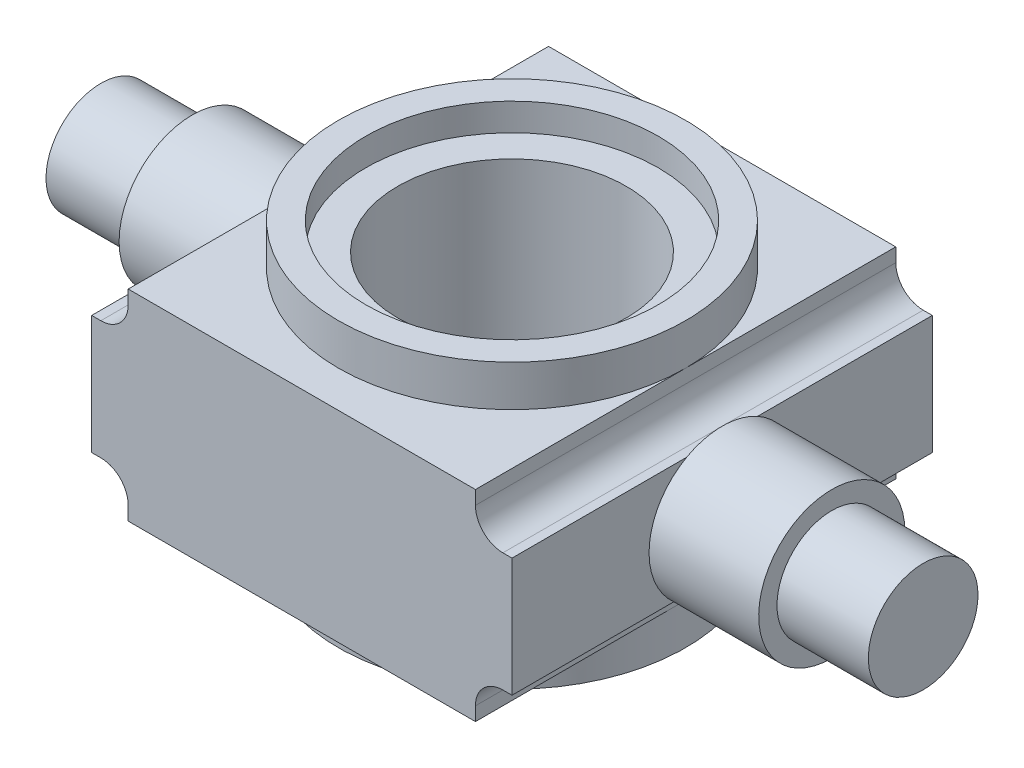
ISO-10303-21;
HEADER;
FILE_DESCRIPTION(('STEP AP214'),'2;1');
FILE_NAME('part.step','',(''),(''),'','','');
FILE_SCHEMA(('AUTOMOTIVE_DESIGN { 1 0 10303 214 1 1 1 1 }'));
ENDSEC;
DATA;
#1=APPLICATION_CONTEXT('core data for automotive mechanical design processes');
#2=APPLICATION_PROTOCOL_DEFINITION('international standard','automotive_design',2000,#1);
#3=PRODUCT_CONTEXT('',#1,'mechanical');
#4=PRODUCT('Part','Part','',(#3));
#5=PRODUCT_RELATED_PRODUCT_CATEGORY('part','',(#4));
#6=PRODUCT_DEFINITION_FORMATION('','',#4);
#7=PRODUCT_DEFINITION_CONTEXT('part definition',#1,'design');
#8=PRODUCT_DEFINITION('design','',#6,#7);
#9=PRODUCT_DEFINITION_SHAPE('','',#8);
#10=(LENGTH_UNIT() NAMED_UNIT(*) SI_UNIT(.MILLI.,.METRE.));
#11=(NAMED_UNIT(*) PLANE_ANGLE_UNIT() SI_UNIT($,.RADIAN.));
#12=(NAMED_UNIT(*) SI_UNIT($,.STERADIAN.) SOLID_ANGLE_UNIT());
#13=UNCERTAINTY_MEASURE_WITH_UNIT(LENGTH_MEASURE(1.E-05),#10,'distance_accuracy_value','');
#14=(GEOMETRIC_REPRESENTATION_CONTEXT(3) GLOBAL_UNCERTAINTY_ASSIGNED_CONTEXT((#13)) GLOBAL_UNIT_ASSIGNED_CONTEXT((#10,
#11,#12)) REPRESENTATION_CONTEXT('',''));
#15=CARTESIAN_POINT('',(0.,0.,0.));
#16=DIRECTION('',(0.,0.,1.));
#17=DIRECTION('',(1.,0.,0.));
#18=AXIS2_PLACEMENT_3D('',#15,#16,#17);
#19=CARTESIAN_POINT('',(23.,22.,-23.));
#20=DIRECTION('',(-1.,0.,0.));
#21=DIRECTION('',(0.,0.,1.));
#22=AXIS2_PLACEMENT_3D('',#19,#20,#21);
#23=PLANE('',#22);
#24=DIRECTION('',(0.,-1.,0.));
#25=VECTOR('',#24,1.);
#26=CARTESIAN_POINT('',(23.,22.,-23.));
#27=LINE('',#26,#25);
#28=CARTESIAN_POINT('',(23.,17.5,-23.));
#29=VERTEX_POINT('',#28);
#30=CARTESIAN_POINT('',(23.,4.5,-23.));
#31=VERTEX_POINT('',#30);
#32=EDGE_CURVE('E47',#29,#31,#27,.T.);
#33=ORIENTED_EDGE('',*,*,#32,.F.);
#34=DIRECTION('',(0.,0.,1.));
#35=VECTOR('',#34,1.);
#36=CARTESIAN_POINT('',(23.,17.5,-23.));
#37=LINE('',#36,#35);
#38=CARTESIAN_POINT('',(23.,17.5,-3.88327264948309));
#39=VERTEX_POINT('',#38);
#40=EDGE_CURVE('E480',#29,#39,#37,.T.);
#41=ORIENTED_EDGE('',*,*,#40,.T.);
#42=CARTESIAN_POINT('',(23.,10.5057027851416,0.));
#43=DIRECTION('',(1.,0.,0.));
#44=DIRECTION('',(0.,0.,-1.));
#45=AXIS2_PLACEMENT_3D('',#42,#43,#44);
#46=CIRCLE('',#45,8.);
#47=CARTESIAN_POINT('',(23.,4.5,-5.28502923894873));
#48=VERTEX_POINT('',#47);
#49=EDGE_CURVE('E418',#48,#39,#46,.T.);
#50=ORIENTED_EDGE('',*,*,#49,.F.);
#51=DIRECTION('',(0.,0.,1.));
#52=VECTOR('',#51,1.);
#53=CARTESIAN_POINT('',(23.,4.5,-23.));
#54=LINE('',#53,#52);
#55=EDGE_CURVE('E61',#31,#48,#54,.T.);
#56=ORIENTED_EDGE('',*,*,#55,.F.);
#57=EDGE_LOOP('',(#33,#41,#50,#56));
#58=FACE_BOUND('',#57,.T.);
#59=ADVANCED_FACE('F43',(#58),#23,.F.);
#60=CARTESIAN_POINT('',(-23.,22.,-23.));
#61=DIRECTION('',(1.,0.,0.));
#62=DIRECTION('',(0.,0.,-1.));
#63=AXIS2_PLACEMENT_3D('',#60,#61,#62);
#64=PLANE('',#63);
#65=DIRECTION('',(0.,-1.,0.));
#66=VECTOR('',#65,1.);
#67=CARTESIAN_POINT('',(-23.,22.,-23.));
#68=LINE('',#67,#66);
#69=CARTESIAN_POINT('',(-23.,17.5,-23.));
#70=VERTEX_POINT('',#69);
#71=CARTESIAN_POINT('',(-23.,4.5,-23.));
#72=VERTEX_POINT('',#71);
#73=EDGE_CURVE('E248',#70,#72,#68,.T.);
#74=ORIENTED_EDGE('',*,*,#73,.T.);
#75=DIRECTION('',(0.,0.,1.));
#76=VECTOR('',#75,1.);
#77=CARTESIAN_POINT('',(-23.,4.5,-23.));
#78=LINE('',#77,#76);
#79=CARTESIAN_POINT('',(-23.,4.5,-4.66368952654441));
#80=VERTEX_POINT('',#79);
#81=EDGE_CURVE('E329',#72,#80,#78,.T.);
#82=ORIENTED_EDGE('',*,*,#81,.T.);
#83=CARTESIAN_POINT('',(-23.,11.,0.));
#84=DIRECTION('',(-1.,0.,0.));
#85=DIRECTION('',(0.,0.,1.));
#86=AXIS2_PLACEMENT_3D('',#83,#84,#85);
#87=CIRCLE('',#86,8.);
#88=CARTESIAN_POINT('',(-23.,17.5,-4.66368952654441));
#89=VERTEX_POINT('',#88);
#90=EDGE_CURVE('E399',#89,#80,#87,.T.);
#91=ORIENTED_EDGE('',*,*,#90,.F.);
#92=DIRECTION('',(0.,0.,1.));
#93=VECTOR('',#92,1.);
#94=CARTESIAN_POINT('',(-23.,17.5,-23.));
#95=LINE('',#94,#93);
#96=EDGE_CURVE('E384',#70,#89,#95,.T.);
#97=ORIENTED_EDGE('',*,*,#96,.F.);
#98=EDGE_LOOP('',(#74,#82,#91,#97));
#99=FACE_BOUND('',#98,.T.);
#100=ADVANCED_FACE('F535',(#99),#64,.F.);
#101=CARTESIAN_POINT('',(0.,22.,0.));
#102=DIRECTION('',(0.,1.,0.));
#103=DIRECTION('',(0.,0.,1.));
#104=AXIS2_PLACEMENT_3D('',#101,#102,#103);
#105=PLANE('',#104);
#106=DIRECTION('',(0.,0.,1.));
#107=VECTOR('',#106,1.);
#108=CARTESIAN_POINT('',(19.,22.,-23.));
#109=LINE('',#108,#107);
#110=CARTESIAN_POINT('',(19.,22.,-23.));
#111=VERTEX_POINT('',#110);
#112=CARTESIAN_POINT('',(19.,22.,0.));
#113=VERTEX_POINT('',#112);
#114=EDGE_CURVE('E310',#111,#113,#109,.T.);
#115=ORIENTED_EDGE('',*,*,#114,.F.);
#116=DIRECTION('',(-1.,0.,0.));
#117=VECTOR('',#116,1.);
#118=CARTESIAN_POINT('',(-23.,22.,-23.));
#119=LINE('',#118,#117);
#120=CARTESIAN_POINT('',(-19.,22.,-23.));
#121=VERTEX_POINT('',#120);
#122=EDGE_CURVE('E228',#111,#121,#119,.T.);
#123=ORIENTED_EDGE('',*,*,#122,.T.);
#124=DIRECTION('',(0.,0.,1.));
#125=VECTOR('',#124,1.);
#126=CARTESIAN_POINT('',(-19.,22.,-23.));
#127=LINE('',#126,#125);
#128=CARTESIAN_POINT('',(-19.,22.,0.));
#129=VERTEX_POINT('',#128);
#130=EDGE_CURVE('E373',#121,#129,#127,.T.);
#131=ORIENTED_EDGE('',*,*,#130,.T.);
#132=CARTESIAN_POINT('',(0.,22.,0.));
#133=DIRECTION('',(0.,1.,0.));
#134=DIRECTION('',(0.,0.,1.));
#135=AXIS2_PLACEMENT_3D('',#132,#133,#134);
#136=CIRCLE('',#135,19.);
#137=EDGE_CURVE('E264',#113,#129,#136,.T.);
#138=ORIENTED_EDGE('',*,*,#137,.F.);
#139=EDGE_LOOP('',(#115,#123,#131,#138));
#140=FACE_BOUND('',#139,.T.);
#141=ADVANCED_FACE('F513',(#140),#105,.T.);
#142=CARTESIAN_POINT('',(0.,0.,0.));
#143=DIRECTION('',(0.,1.,0.));
#144=DIRECTION('',(0.,0.,1.));
#145=AXIS2_PLACEMENT_3D('',#142,#143,#144);
#146=PLANE('',#145);
#147=DIRECTION('',(1.,0.,0.));
#148=VECTOR('',#147,1.);
#149=CARTESIAN_POINT('',(-23.,0.,23.));
#150=LINE('',#149,#148);
#151=CARTESIAN_POINT('',(-19.,0.,23.));
#152=VERTEX_POINT('',#151);
#153=CARTESIAN_POINT('',(19.,0.,23.));
#154=VERTEX_POINT('',#153);
#155=EDGE_CURVE('E215',#152,#154,#150,.T.);
#156=ORIENTED_EDGE('',*,*,#155,.F.);
#157=DIRECTION('',(0.,0.,1.));
#158=VECTOR('',#157,1.);
#159=CARTESIAN_POINT('',(-19.,0.,-23.));
#160=LINE('',#159,#158);
#161=CARTESIAN_POINT('',(-19.,0.,0.));
#162=VERTEX_POINT('',#161);
#163=EDGE_CURVE('E322',#162,#152,#160,.T.);
#164=ORIENTED_EDGE('',*,*,#163,.F.);
#165=CARTESIAN_POINT('',(0.,0.,0.));
#166=DIRECTION('',(0.,-1.,0.));
#167=DIRECTION('',(0.,0.,-1.));
#168=AXIS2_PLACEMENT_3D('',#165,#166,#167);
#169=CIRCLE('',#168,19.);
#170=CARTESIAN_POINT('',(19.,0.,0.));
#171=VERTEX_POINT('',#170);
#172=EDGE_CURVE('E217',#171,#162,#169,.T.);
#173=ORIENTED_EDGE('',*,*,#172,.F.);
#174=DIRECTION('',(0.,0.,1.));
#175=VECTOR('',#174,1.);
#176=CARTESIAN_POINT('',(19.,0.,-23.));
#177=LINE('',#176,#175);
#178=EDGE_CURVE('E198',#171,#154,#177,.T.);
#179=ORIENTED_EDGE('',*,*,#178,.T.);
#180=EDGE_LOOP('',(#156,#164,#173,#179));
#181=FACE_BOUND('',#180,.T.);
#182=ADVANCED_FACE('F213',(#181),#146,.F.);
#183=CARTESIAN_POINT('',(23.,17.5,3.88327264948309));
#184=VERTEX_POINT('',#183);
#185=CARTESIAN_POINT('',(23.,4.5,5.28502923894873));
#186=VERTEX_POINT('',#185);
#187=EDGE_CURVE('E417',#184,#186,#46,.T.);
#188=ORIENTED_EDGE('',*,*,#187,.F.);
#189=CARTESIAN_POINT('',(23.,17.5,23.));
#190=VERTEX_POINT('',#189);
#191=EDGE_CURVE('E344',#184,#190,#37,.T.);
#192=ORIENTED_EDGE('',*,*,#191,.T.);
#193=DIRECTION('',(0.,-1.,0.));
#194=VECTOR('',#193,1.);
#195=CARTESIAN_POINT('',(23.,22.,23.));
#196=LINE('',#195,#194);
#197=CARTESIAN_POINT('',(23.,4.5,23.));
#198=VERTEX_POINT('',#197);
#199=EDGE_CURVE('E241',#190,#198,#196,.T.);
#200=ORIENTED_EDGE('',*,*,#199,.T.);
#201=EDGE_CURVE('E496',#186,#198,#54,.T.);
#202=ORIENTED_EDGE('',*,*,#201,.F.);
#203=EDGE_LOOP('',(#188,#192,#200,#202));
#204=FACE_BOUND('',#203,.T.);
#205=ADVANCED_FACE('F45',(#204),#23,.F.);
#206=CARTESIAN_POINT('',(-23.,22.,-23.));
#207=DIRECTION('',(0.,0.,1.));
#208=DIRECTION('',(1.,0.,0.));
#209=AXIS2_PLACEMENT_3D('',#206,#207,#208);
#210=PLANE('',#209);
#211=CARTESIAN_POINT('',(22.,20.5,-23.));
#212=DIRECTION('',(0.,0.,1.));
#213=DIRECTION('',(-1.,0.,0.));
#214=AXIS2_PLACEMENT_3D('',#211,#212,#213);
#215=CIRCLE('',#214,3.);
#216=CARTESIAN_POINT('',(19.,20.5,-23.));
#217=VERTEX_POINT('',#216);
#218=CARTESIAN_POINT('',(22.,17.5,-23.));
#219=VERTEX_POINT('',#218);
#220=EDGE_CURVE('E309',#217,#219,#215,.T.);
#221=ORIENTED_EDGE('',*,*,#220,.T.);
#222=DIRECTION('',(1.,0.,0.));
#223=VECTOR('',#222,1.);
#224=CARTESIAN_POINT('',(22.,17.5,-23.));
#225=LINE('',#224,#223);
#226=EDGE_CURVE('E306',#219,#29,#225,.T.);
#227=ORIENTED_EDGE('',*,*,#226,.T.);
#228=ORIENTED_EDGE('',*,*,#32,.T.);
#229=DIRECTION('',(-1.,0.,0.));
#230=VECTOR('',#229,1.);
#231=CARTESIAN_POINT('',(23.,4.5,-23.));
#232=LINE('',#231,#230);
#233=CARTESIAN_POINT('',(22.,4.5,-23.));
#234=VERTEX_POINT('',#233);
#235=EDGE_CURVE('E208',#31,#234,#232,.T.);
#236=ORIENTED_EDGE('',*,*,#235,.T.);
#237=CARTESIAN_POINT('',(22.,1.5,-23.));
#238=DIRECTION('',(0.,0.,1.));
#239=DIRECTION('',(-1.,0.,0.));
#240=AXIS2_PLACEMENT_3D('',#237,#238,#239);
#241=CIRCLE('',#240,3.);
#242=CARTESIAN_POINT('',(19.,1.49999999999998,-23.));
#243=VERTEX_POINT('',#242);
#244=EDGE_CURVE('E466',#234,#243,#241,.T.);
#245=ORIENTED_EDGE('',*,*,#244,.T.);
#246=DIRECTION('',(0.,-1.,0.));
#247=VECTOR('',#246,1.);
#248=CARTESIAN_POINT('',(19.,1.49999999999998,-23.));
#249=LINE('',#248,#247);
#250=CARTESIAN_POINT('',(19.,0.,-23.));
#251=VERTEX_POINT('',#250);
#252=EDGE_CURVE('E463',#243,#251,#249,.T.);
#253=ORIENTED_EDGE('',*,*,#252,.T.);
#254=DIRECTION('',(-1.,0.,0.));
#255=VECTOR('',#254,1.);
#256=CARTESIAN_POINT('',(-23.,0.,-23.));
#257=LINE('',#256,#255);
#258=CARTESIAN_POINT('',(-19.,0.,-23.));
#259=VERTEX_POINT('',#258);
#260=EDGE_CURVE('E229',#251,#259,#257,.T.);
#261=ORIENTED_EDGE('',*,*,#260,.T.);
#262=DIRECTION('',(0.,1.,0.));
#263=VECTOR('',#262,1.);
#264=CARTESIAN_POINT('',(-19.,0.,-23.));
#265=LINE('',#264,#263);
#266=CARTESIAN_POINT('',(-19.,1.49999999999998,-23.));
#267=VERTEX_POINT('',#266);
#268=EDGE_CURVE('E338',#259,#267,#265,.T.);
#269=ORIENTED_EDGE('',*,*,#268,.T.);
#270=CARTESIAN_POINT('',(-22.,1.5,-23.));
#271=DIRECTION('',(0.,0.,1.));
#272=DIRECTION('',(1.,0.,0.));
#273=AXIS2_PLACEMENT_3D('',#270,#271,#272);
#274=CIRCLE('',#273,3.);
#275=CARTESIAN_POINT('',(-22.,4.5,-23.));
#276=VERTEX_POINT('',#275);
#277=EDGE_CURVE('E348',#267,#276,#274,.T.);
#278=ORIENTED_EDGE('',*,*,#277,.T.);
#279=DIRECTION('',(-1.,0.,0.));
#280=VECTOR('',#279,1.);
#281=CARTESIAN_POINT('',(-22.,4.5,-23.));
#282=LINE('',#281,#280);
#283=EDGE_CURVE('E321',#276,#72,#282,.T.);
#284=ORIENTED_EDGE('',*,*,#283,.T.);
#285=ORIENTED_EDGE('',*,*,#73,.F.);
#286=DIRECTION('',(1.,0.,0.));
#287=VECTOR('',#286,1.);
#288=CARTESIAN_POINT('',(-22.,17.5,-23.));
#289=LINE('',#288,#287);
#290=CARTESIAN_POINT('',(-22.,17.5,-23.));
#291=VERTEX_POINT('',#290);
#292=EDGE_CURVE('E355',#70,#291,#289,.T.);
#293=ORIENTED_EDGE('',*,*,#292,.T.);
#294=CARTESIAN_POINT('',(-22.,20.5,-23.));
#295=DIRECTION('',(0.,0.,1.));
#296=DIRECTION('',(1.,0.,0.));
#297=AXIS2_PLACEMENT_3D('',#294,#295,#296);
#298=CIRCLE('',#297,3.);
#299=CARTESIAN_POINT('',(-19.,20.5,-23.));
#300=VERTEX_POINT('',#299);
#301=EDGE_CURVE('E359',#291,#300,#298,.T.);
#302=ORIENTED_EDGE('',*,*,#301,.T.);
#303=DIRECTION('',(0.,1.,0.));
#304=VECTOR('',#303,1.);
#305=CARTESIAN_POINT('',(-19.,22.,-23.));
#306=LINE('',#305,#304);
#307=EDGE_CURVE('E363',#300,#121,#306,.T.);
#308=ORIENTED_EDGE('',*,*,#307,.T.);
#309=ORIENTED_EDGE('',*,*,#122,.F.);
#310=DIRECTION('',(0.,-1.,0.));
#311=VECTOR('',#310,1.);
#312=CARTESIAN_POINT('',(19.,22.,-23.));
#313=LINE('',#312,#311);
#314=EDGE_CURVE('E314',#111,#217,#313,.T.);
#315=ORIENTED_EDGE('',*,*,#314,.T.);
#316=EDGE_LOOP('',(#221,#227,#228,#236,#245,#253,#261,#269,#278,#284,#285,#293,#302,#308,#309,#315));
#317=FACE_BOUND('',#316,.T.);
#318=ADVANCED_FACE('F514',(#317),#210,.F.);
#319=CARTESIAN_POINT('',(-23.,4.5,4.66368952654441));
#320=VERTEX_POINT('',#319);
#321=CARTESIAN_POINT('',(-23.,17.5,4.66368952654441));
#322=VERTEX_POINT('',#321);
#323=EDGE_CURVE('E400',#320,#322,#87,.T.);
#324=ORIENTED_EDGE('',*,*,#323,.F.);
#325=CARTESIAN_POINT('',(-23.,4.5,23.));
#326=VERTEX_POINT('',#325);
#327=EDGE_CURVE('E333',#320,#326,#78,.T.);
#328=ORIENTED_EDGE('',*,*,#327,.T.);
#329=DIRECTION('',(0.,-1.,0.));
#330=VECTOR('',#329,1.);
#331=CARTESIAN_POINT('',(-23.,22.,23.));
#332=LINE('',#331,#330);
#333=CARTESIAN_POINT('',(-23.,17.5,23.));
#334=VERTEX_POINT('',#333);
#335=EDGE_CURVE('E245',#334,#326,#332,.T.);
#336=ORIENTED_EDGE('',*,*,#335,.F.);
#337=EDGE_CURVE('E366',#322,#334,#95,.T.);
#338=ORIENTED_EDGE('',*,*,#337,.F.);
#339=EDGE_LOOP('',(#324,#328,#336,#338));
#340=FACE_BOUND('',#339,.T.);
#341=ADVANCED_FACE('F542',(#340),#64,.F.);
#342=CARTESIAN_POINT('',(-23.,22.,23.));
#343=DIRECTION('',(0.,0.,-1.));
#344=DIRECTION('',(-1.,0.,0.));
#345=AXIS2_PLACEMENT_3D('',#342,#343,#344);
#346=PLANE('',#345);
#347=ORIENTED_EDGE('',*,*,#199,.F.);
#348=DIRECTION('',(1.,0.,0.));
#349=VECTOR('',#348,1.);
#350=CARTESIAN_POINT('',(22.,17.5,23.));
#351=LINE('',#350,#349);
#352=CARTESIAN_POINT('',(22.,17.5,23.));
#353=VERTEX_POINT('',#352);
#354=EDGE_CURVE('E302',#353,#190,#351,.T.);
#355=ORIENTED_EDGE('',*,*,#354,.F.);
#356=CARTESIAN_POINT('',(22.,20.5,23.));
#357=DIRECTION('',(0.,0.,1.));
#358=DIRECTION('',(-1.,0.,0.));
#359=AXIS2_PLACEMENT_3D('',#356,#357,#358);
#360=CIRCLE('',#359,3.);
#361=CARTESIAN_POINT('',(19.,20.5,23.));
#362=VERTEX_POINT('',#361);
#363=EDGE_CURVE('E292',#362,#353,#360,.T.);
#364=ORIENTED_EDGE('',*,*,#363,.F.);
#365=DIRECTION('',(0.,-1.,0.));
#366=VECTOR('',#365,1.);
#367=CARTESIAN_POINT('',(19.,22.,23.));
#368=LINE('',#367,#366);
#369=CARTESIAN_POINT('',(19.,22.,23.));
#370=VERTEX_POINT('',#369);
#371=EDGE_CURVE('E289',#370,#362,#368,.T.);
#372=ORIENTED_EDGE('',*,*,#371,.F.);
#373=DIRECTION('',(1.,0.,0.));
#374=VECTOR('',#373,1.);
#375=CARTESIAN_POINT('',(-23.,22.,23.));
#376=LINE('',#375,#374);
#377=CARTESIAN_POINT('',(-19.,22.,23.));
#378=VERTEX_POINT('',#377);
#379=EDGE_CURVE('E234',#378,#370,#376,.T.);
#380=ORIENTED_EDGE('',*,*,#379,.F.);
#381=DIRECTION('',(0.,1.,0.));
#382=VECTOR('',#381,1.);
#383=CARTESIAN_POINT('',(-19.,22.,23.));
#384=LINE('',#383,#382);
#385=CARTESIAN_POINT('',(-19.,20.5,23.));
#386=VERTEX_POINT('',#385);
#387=EDGE_CURVE('E286',#386,#378,#384,.T.);
#388=ORIENTED_EDGE('',*,*,#387,.F.);
#389=CARTESIAN_POINT('',(-22.,20.5,23.));
#390=DIRECTION('',(0.,0.,1.));
#391=DIRECTION('',(1.,0.,0.));
#392=AXIS2_PLACEMENT_3D('',#389,#390,#391);
#393=CIRCLE('',#392,3.);
#394=CARTESIAN_POINT('',(-22.,17.5,23.));
#395=VERTEX_POINT('',#394);
#396=EDGE_CURVE('E300',#395,#386,#393,.T.);
#397=ORIENTED_EDGE('',*,*,#396,.F.);
#398=DIRECTION('',(1.,0.,0.));
#399=VECTOR('',#398,1.);
#400=CARTESIAN_POINT('',(-22.,17.5,23.));
#401=LINE('',#400,#399);
#402=EDGE_CURVE('E295',#334,#395,#401,.T.);
#403=ORIENTED_EDGE('',*,*,#402,.F.);
#404=ORIENTED_EDGE('',*,*,#335,.T.);
#405=DIRECTION('',(-1.,0.,0.));
#406=VECTOR('',#405,1.);
#407=CARTESIAN_POINT('',(-22.,4.5,23.));
#408=LINE('',#407,#406);
#409=CARTESIAN_POINT('',(-22.,4.5,23.));
#410=VERTEX_POINT('',#409);
#411=EDGE_CURVE('E334',#410,#326,#408,.T.);
#412=ORIENTED_EDGE('',*,*,#411,.F.);
#413=CARTESIAN_POINT('',(-22.,1.5,23.));
#414=DIRECTION('',(0.,0.,1.));
#415=DIRECTION('',(1.,0.,0.));
#416=AXIS2_PLACEMENT_3D('',#413,#414,#415);
#417=CIRCLE('',#416,3.);
#418=CARTESIAN_POINT('',(-19.,1.49999999999998,23.));
#419=VERTEX_POINT('',#418);
#420=EDGE_CURVE('E337',#419,#410,#417,.T.);
#421=ORIENTED_EDGE('',*,*,#420,.F.);
#422=DIRECTION('',(0.,1.,0.));
#423=VECTOR('',#422,1.);
#424=CARTESIAN_POINT('',(-19.,0.,23.));
#425=LINE('',#424,#423);
#426=EDGE_CURVE('E226',#152,#419,#425,.T.);
#427=ORIENTED_EDGE('',*,*,#426,.F.);
#428=ORIENTED_EDGE('',*,*,#155,.T.);
#429=DIRECTION('',(0.,-1.,0.));
#430=VECTOR('',#429,1.);
#431=CARTESIAN_POINT('',(19.,1.49999999999998,23.));
#432=LINE('',#431,#430);
#433=CARTESIAN_POINT('',(19.,1.49999999999998,23.));
#434=VERTEX_POINT('',#433);
#435=EDGE_CURVE('E195',#434,#154,#432,.T.);
#436=ORIENTED_EDGE('',*,*,#435,.F.);
#437=CARTESIAN_POINT('',(22.,1.5,23.));
#438=DIRECTION('',(0.,0.,1.));
#439=DIRECTION('',(-1.,0.,0.));
#440=AXIS2_PLACEMENT_3D('',#437,#438,#439);
#441=CIRCLE('',#440,3.);
#442=CARTESIAN_POINT('',(22.,4.5,23.));
#443=VERTEX_POINT('',#442);
#444=EDGE_CURVE('E207',#443,#434,#441,.T.);
#445=ORIENTED_EDGE('',*,*,#444,.F.);
#446=DIRECTION('',(-1.,0.,0.));
#447=VECTOR('',#446,1.);
#448=CARTESIAN_POINT('',(23.,4.5,23.));
#449=LINE('',#448,#447);
#450=EDGE_CURVE('E459',#198,#443,#449,.T.);
#451=ORIENTED_EDGE('',*,*,#450,.F.);
#452=EDGE_LOOP('',(#347,#355,#364,#372,#380,#388,#397,#403,#404,#412,#421,#427,#428,#436,#445,#451));
#453=FACE_BOUND('',#452,.T.);
#454=ADVANCED_FACE('F223',(#453),#346,.F.);
#455=EDGE_CURVE('E281',#113,#370,#109,.T.);
#456=ORIENTED_EDGE('',*,*,#455,.F.);
#457=EDGE_CURVE('E257',#129,#113,#136,.T.);
#458=ORIENTED_EDGE('',*,*,#457,.F.);
#459=EDGE_CURVE('E282',#129,#378,#127,.T.);
#460=ORIENTED_EDGE('',*,*,#459,.T.);
#461=ORIENTED_EDGE('',*,*,#379,.T.);
#462=EDGE_LOOP('',(#456,#458,#460,#461));
#463=FACE_BOUND('',#462,.T.);
#464=ADVANCED_FACE('F280',(#463),#105,.T.);
#465=EDGE_CURVE('E271',#162,#171,#169,.T.);
#466=ORIENTED_EDGE('',*,*,#465,.F.);
#467=EDGE_CURVE('E318',#259,#162,#160,.T.);
#468=ORIENTED_EDGE('',*,*,#467,.F.);
#469=ORIENTED_EDGE('',*,*,#260,.F.);
#470=EDGE_CURVE('E219',#251,#171,#177,.T.);
#471=ORIENTED_EDGE('',*,*,#470,.T.);
#472=EDGE_LOOP('',(#466,#468,#469,#471));
#473=FACE_BOUND('',#472,.T.);
#474=ADVANCED_FACE('F448',(#473),#146,.F.);
#475=CARTESIAN_POINT('',(0.,26.5,0.));
#476=DIRECTION('',(0.,-1.,0.));
#477=DIRECTION('',(0.,0.,-1.));
#478=AXIS2_PLACEMENT_3D('',#475,#476,#477);
#479=CYLINDRICAL_SURFACE('',#478,19.);
#480=CARTESIAN_POINT('',(0.,26.5,0.));
#481=DIRECTION('',(0.,1.,0.));
#482=DIRECTION('',(0.,0.,1.));
#483=AXIS2_PLACEMENT_3D('',#480,#481,#482);
#484=CIRCLE('',#483,19.);
#485=CARTESIAN_POINT('',(0.,26.5,19.));
#486=VERTEX_POINT('',#485);
#487=EDGE_CURVE('E237',#486,#486,#484,.T.);
#488=ORIENTED_EDGE('',*,*,#487,.F.);
#489=EDGE_LOOP('',(#488));
#490=FACE_BOUND('',#489,.T.);
#491=ORIENTED_EDGE('',*,*,#137,.T.);
#492=ORIENTED_EDGE('',*,*,#457,.T.);
#493=EDGE_LOOP('',(#491,#492));
#494=FACE_BOUND('',#493,.T.);
#495=ADVANCED_FACE('F519',(#490,#494),#479,.T.);
#496=CARTESIAN_POINT('',(0.,26.5,0.));
#497=DIRECTION('',(0.,1.,0.));
#498=DIRECTION('',(0.,0.,1.));
#499=AXIS2_PLACEMENT_3D('',#496,#497,#498);
#500=PLANE('',#499);
#501=CARTESIAN_POINT('',(0.,26.5,0.));
#502=DIRECTION('',(0.,1.,0.));
#503=DIRECTION('',(0.,0.,1.));
#504=AXIS2_PLACEMENT_3D('',#501,#502,#503);
#505=CIRCLE('',#504,16.);
#506=CARTESIAN_POINT('',(0.,26.5,16.));
#507=VERTEX_POINT('',#506);
#508=EDGE_CURVE('E423',#507,#507,#505,.T.);
#509=ORIENTED_EDGE('',*,*,#508,.F.);
#510=EDGE_LOOP('',(#509));
#511=FACE_BOUND('',#510,.T.);
#512=ORIENTED_EDGE('',*,*,#487,.T.);
#513=EDGE_LOOP('',(#512));
#514=FACE_BOUND('',#513,.T.);
#515=ADVANCED_FACE('F521',(#511,#514),#500,.T.);
#516=CARTESIAN_POINT('',(0.,-4.5,0.));
#517=DIRECTION('',(0.,1.,0.));
#518=DIRECTION('',(0.,0.,1.));
#519=AXIS2_PLACEMENT_3D('',#516,#517,#518);
#520=CYLINDRICAL_SURFACE('',#519,19.);
#521=CARTESIAN_POINT('',(0.,-4.5,0.));
#522=DIRECTION('',(0.,-1.,0.));
#523=DIRECTION('',(0.,0.,-1.));
#524=AXIS2_PLACEMENT_3D('',#521,#522,#523);
#525=CIRCLE('',#524,19.);
#526=CARTESIAN_POINT('',(0.,-4.5,-19.));
#527=VERTEX_POINT('',#526);
#528=EDGE_CURVE('E431',#527,#527,#525,.T.);
#529=ORIENTED_EDGE('',*,*,#528,.F.);
#530=EDGE_LOOP('',(#529));
#531=FACE_BOUND('',#530,.T.);
#532=ORIENTED_EDGE('',*,*,#172,.T.);
#533=ORIENTED_EDGE('',*,*,#465,.T.);
#534=EDGE_LOOP('',(#532,#533));
#535=FACE_BOUND('',#534,.T.);
#536=ADVANCED_FACE('F445',(#531,#535),#520,.T.);
#537=CARTESIAN_POINT('',(0.,-4.5,0.));
#538=DIRECTION('',(0.,-1.,0.));
#539=DIRECTION('',(0.,0.,-1.));
#540=AXIS2_PLACEMENT_3D('',#537,#538,#539);
#541=PLANE('',#540);
#542=CARTESIAN_POINT('',(0.,-4.5,0.));
#543=DIRECTION('',(0.,1.,0.));
#544=DIRECTION('',(0.,0.,1.));
#545=AXIS2_PLACEMENT_3D('',#542,#543,#544);
#546=CIRCLE('',#545,12.5);
#547=CARTESIAN_POINT('',(0.,-4.5,12.5));
#548=VERTEX_POINT('',#547);
#549=EDGE_CURVE('E419',#548,#548,#546,.T.);
#550=ORIENTED_EDGE('',*,*,#549,.T.);
#551=EDGE_LOOP('',(#550));
#552=FACE_BOUND('',#551,.T.);
#553=ORIENTED_EDGE('',*,*,#528,.T.);
#554=EDGE_LOOP('',(#553));
#555=FACE_BOUND('',#554,.T.);
#556=ADVANCED_FACE('F665',(#552,#555),#541,.T.);
#557=CARTESIAN_POINT('',(0.,23.5,0.));
#558=DIRECTION('',(0.,1.,0.));
#559=DIRECTION('',(0.,0.,1.));
#560=AXIS2_PLACEMENT_3D('',#557,#558,#559);
#561=CYLINDRICAL_SURFACE('',#560,16.);
#562=CARTESIAN_POINT('',(0.,23.5,0.));
#563=DIRECTION('',(0.,1.,0.));
#564=DIRECTION('',(0.,0.,1.));
#565=AXIS2_PLACEMENT_3D('',#562,#563,#564);
#566=CIRCLE('',#565,16.);
#567=CARTESIAN_POINT('',(0.,23.5,16.));
#568=VERTEX_POINT('',#567);
#569=EDGE_CURVE('E427',#568,#568,#566,.T.);
#570=ORIENTED_EDGE('',*,*,#569,.F.);
#571=EDGE_LOOP('',(#570));
#572=FACE_BOUND('',#571,.T.);
#573=ORIENTED_EDGE('',*,*,#508,.T.);
#574=EDGE_LOOP('',(#573));
#575=FACE_BOUND('',#574,.T.);
#576=ADVANCED_FACE('F661',(#572,#575),#561,.F.);
#577=CARTESIAN_POINT('',(0.,23.5,0.));
#578=DIRECTION('',(0.,1.,0.));
#579=DIRECTION('',(0.,0.,1.));
#580=AXIS2_PLACEMENT_3D('',#577,#578,#579);
#581=PLANE('',#580);
#582=CARTESIAN_POINT('',(0.,23.5,0.));
#583=DIRECTION('',(0.,1.,0.));
#584=DIRECTION('',(0.,0.,1.));
#585=AXIS2_PLACEMENT_3D('',#582,#583,#584);
#586=CIRCLE('',#585,12.5);
#587=CARTESIAN_POINT('',(0.,23.5,12.5));
#588=VERTEX_POINT('',#587);
#589=EDGE_CURVE('E413',#588,#588,#586,.T.);
#590=ORIENTED_EDGE('',*,*,#589,.F.);
#591=EDGE_LOOP('',(#590));
#592=FACE_BOUND('',#591,.T.);
#593=ORIENTED_EDGE('',*,*,#569,.T.);
#594=EDGE_LOOP('',(#593));
#595=FACE_BOUND('',#594,.T.);
#596=ADVANCED_FACE('F657',(#592,#595),#581,.T.);
#597=CARTESIAN_POINT('',(0.,-4.5,0.));
#598=DIRECTION('',(0.,1.,0.));
#599=DIRECTION('',(0.,0.,1.));
#600=AXIS2_PLACEMENT_3D('',#597,#598,#599);
#601=CYLINDRICAL_SURFACE('',#600,12.5);
#602=ORIENTED_EDGE('',*,*,#549,.F.);
#603=EDGE_LOOP('',(#602));
#604=FACE_BOUND('',#603,.T.);
#605=ORIENTED_EDGE('',*,*,#589,.T.);
#606=EDGE_LOOP('',(#605));
#607=FACE_BOUND('',#606,.T.);
#608=ADVANCED_FACE('F653',(#604,#607),#601,.F.);
#609=CARTESIAN_POINT('',(35.,10.5057027851416,0.));
#610=DIRECTION('',(-1.,0.,0.));
#611=DIRECTION('',(0.,0.,1.));
#612=AXIS2_PLACEMENT_3D('',#609,#610,#611);
#613=CYLINDRICAL_SURFACE('',#612,8.);
#614=CARTESIAN_POINT('',(35.,10.5057027851416,0.));
#615=DIRECTION('',(1.,0.,0.));
#616=DIRECTION('',(0.,0.,-1.));
#617=AXIS2_PLACEMENT_3D('',#614,#615,#616);
#618=CIRCLE('',#617,8.);
#619=CARTESIAN_POINT('',(35.,10.5057027851416,-8.));
#620=VERTEX_POINT('',#619);
#621=EDGE_CURVE('E404',#620,#620,#618,.T.);
#622=ORIENTED_EDGE('',*,*,#621,.F.);
#623=EDGE_LOOP('',(#622));
#624=FACE_BOUND('',#623,.T.);
#625=EDGE_CURVE('E409',#39,#184,#46,.T.);
#626=ORIENTED_EDGE('',*,*,#625,.T.);
#627=ORIENTED_EDGE('',*,*,#187,.T.);
#628=EDGE_CURVE('E443',#186,#48,#46,.T.);
#629=ORIENTED_EDGE('',*,*,#628,.T.);
#630=ORIENTED_EDGE('',*,*,#49,.T.);
#631=EDGE_LOOP('',(#626,#627,#629,#630));
#632=FACE_BOUND('',#631,.T.);
#633=ADVANCED_FACE('F577',(#624,#632),#613,.T.);
#634=CARTESIAN_POINT('',(35.,10.5057027851416,0.));
#635=DIRECTION('',(1.,0.,0.));
#636=DIRECTION('',(0.,0.,-1.));
#637=AXIS2_PLACEMENT_3D('',#634,#635,#636);
#638=PLANE('',#637);
#639=CARTESIAN_POINT('',(35.,10.5057027851416,0.));
#640=DIRECTION('',(1.,0.,0.));
#641=DIRECTION('',(0.,0.,-1.));
#642=AXIS2_PLACEMENT_3D('',#639,#640,#641);
#643=CIRCLE('',#642,6.);
#644=CARTESIAN_POINT('',(35.,10.5057027851416,-6.));
#645=VERTEX_POINT('',#644);
#646=EDGE_CURVE('E405',#645,#645,#643,.T.);
#647=ORIENTED_EDGE('',*,*,#646,.F.);
#648=EDGE_LOOP('',(#647));
#649=FACE_BOUND('',#648,.T.);
#650=ORIENTED_EDGE('',*,*,#621,.T.);
#651=EDGE_LOOP('',(#650));
#652=FACE_BOUND('',#651,.T.);
#653=ADVANCED_FACE('F646',(#649,#652),#638,.T.);
#654=CARTESIAN_POINT('',(45.,10.5057027851416,0.));
#655=DIRECTION('',(-1.,0.,0.));
#656=DIRECTION('',(0.,0.,1.));
#657=AXIS2_PLACEMENT_3D('',#654,#655,#656);
#658=CYLINDRICAL_SURFACE('',#657,6.);
#659=CARTESIAN_POINT('',(45.,10.5057027851416,0.));
#660=DIRECTION('',(1.,0.,0.));
#661=DIRECTION('',(0.,0.,-1.));
#662=AXIS2_PLACEMENT_3D('',#659,#660,#661);
#663=CIRCLE('',#662,6.);
#664=CARTESIAN_POINT('',(45.,10.5057027851416,-6.));
#665=VERTEX_POINT('',#664);
#666=EDGE_CURVE('E395',#665,#665,#663,.T.);
#667=ORIENTED_EDGE('',*,*,#666,.F.);
#668=EDGE_LOOP('',(#667));
#669=FACE_BOUND('',#668,.T.);
#670=ORIENTED_EDGE('',*,*,#646,.T.);
#671=EDGE_LOOP('',(#670));
#672=FACE_BOUND('',#671,.T.);
#673=ADVANCED_FACE('F642',(#669,#672),#658,.T.);
#674=CARTESIAN_POINT('',(45.,10.5057027851416,0.));
#675=DIRECTION('',(1.,0.,0.));
#676=DIRECTION('',(0.,0.,-1.));
#677=AXIS2_PLACEMENT_3D('',#674,#675,#676);
#678=PLANE('',#677);
#679=ORIENTED_EDGE('',*,*,#666,.T.);
#680=EDGE_LOOP('',(#679));
#681=FACE_BOUND('',#680,.T.);
#682=ADVANCED_FACE('F638',(#681),#678,.T.);
#683=CARTESIAN_POINT('',(-35.,11.,0.));
#684=DIRECTION('',(1.,0.,0.));
#685=DIRECTION('',(0.,0.,-1.));
#686=AXIS2_PLACEMENT_3D('',#683,#684,#685);
#687=CYLINDRICAL_SURFACE('',#686,8.);
#688=CARTESIAN_POINT('',(-35.,11.,0.));
#689=DIRECTION('',(-1.,0.,0.));
#690=DIRECTION('',(0.,0.,1.));
#691=AXIS2_PLACEMENT_3D('',#688,#689,#690);
#692=CIRCLE('',#691,8.);
#693=CARTESIAN_POINT('',(-35.,11.,8.));
#694=VERTEX_POINT('',#693);
#695=EDGE_CURVE('E390',#694,#694,#692,.T.);
#696=ORIENTED_EDGE('',*,*,#695,.F.);
#697=EDGE_LOOP('',(#696));
#698=FACE_BOUND('',#697,.T.);
#699=EDGE_CURVE('E53',#322,#89,#87,.T.);
#700=ORIENTED_EDGE('',*,*,#699,.T.);
#701=ORIENTED_EDGE('',*,*,#90,.T.);
#702=EDGE_CURVE('E565',#80,#320,#87,.T.);
#703=ORIENTED_EDGE('',*,*,#702,.T.);
#704=ORIENTED_EDGE('',*,*,#323,.T.);
#705=EDGE_LOOP('',(#700,#701,#703,#704));
#706=FACE_BOUND('',#705,.T.);
#707=ADVANCED_FACE('F567',(#698,#706),#687,.T.);
#708=CARTESIAN_POINT('',(-35.,11.,0.));
#709=DIRECTION('',(-1.,0.,0.));
#710=DIRECTION('',(0.,0.,1.));
#711=AXIS2_PLACEMENT_3D('',#708,#709,#710);
#712=PLANE('',#711);
#713=CARTESIAN_POINT('',(-35.,11.,0.));
#714=DIRECTION('',(-1.,0.,0.));
#715=DIRECTION('',(0.,0.,1.));
#716=AXIS2_PLACEMENT_3D('',#713,#714,#715);
#717=CIRCLE('',#716,6.);
#718=CARTESIAN_POINT('',(-35.,11.,6.));
#719=VERTEX_POINT('',#718);
#720=EDGE_CURVE('E12',#719,#719,#717,.T.);
#721=ORIENTED_EDGE('',*,*,#720,.F.);
#722=EDGE_LOOP('',(#721));
#723=FACE_BOUND('',#722,.T.);
#724=ORIENTED_EDGE('',*,*,#695,.T.);
#725=EDGE_LOOP('',(#724));
#726=FACE_BOUND('',#725,.T.);
#727=ADVANCED_FACE('F631',(#723,#726),#712,.T.);
#728=CARTESIAN_POINT('',(-45.,11.,0.));
#729=DIRECTION('',(1.,0.,0.));
#730=DIRECTION('',(0.,0.,-1.));
#731=AXIS2_PLACEMENT_3D('',#728,#729,#730);
#732=CYLINDRICAL_SURFACE('',#731,6.);
#733=CARTESIAN_POINT('',(-45.,11.,0.));
#734=DIRECTION('',(-1.,0.,0.));
#735=DIRECTION('',(0.,0.,1.));
#736=AXIS2_PLACEMENT_3D('',#733,#734,#735);
#737=CIRCLE('',#736,6.);
#738=CARTESIAN_POINT('',(-45.,11.,6.));
#739=VERTEX_POINT('',#738);
#740=EDGE_CURVE('E377',#739,#739,#737,.T.);
#741=ORIENTED_EDGE('',*,*,#740,.F.);
#742=EDGE_LOOP('',(#741));
#743=FACE_BOUND('',#742,.T.);
#744=ORIENTED_EDGE('',*,*,#720,.T.);
#745=EDGE_LOOP('',(#744));
#746=FACE_BOUND('',#745,.T.);
#747=ADVANCED_FACE('F627',(#743,#746),#732,.T.);
#748=CARTESIAN_POINT('',(-45.,11.,0.));
#749=DIRECTION('',(-1.,0.,0.));
#750=DIRECTION('',(0.,0.,1.));
#751=AXIS2_PLACEMENT_3D('',#748,#749,#750);
#752=PLANE('',#751);
#753=ORIENTED_EDGE('',*,*,#740,.T.);
#754=EDGE_LOOP('',(#753));
#755=FACE_BOUND('',#754,.T.);
#756=ADVANCED_FACE('F623',(#755),#752,.T.);
#757=CARTESIAN_POINT('',(-23.,17.5,-23.));
#758=DIRECTION('',(-1.,0.,0.));
#759=DIRECTION('',(0.,0.,1.));
#760=AXIS2_PLACEMENT_3D('',#757,#758,#759);
#761=PLANE('',#760);
#762=EDGE_CURVE('E387',#89,#322,#95,.T.);
#763=ORIENTED_EDGE('',*,*,#762,.F.);
#764=ORIENTED_EDGE('',*,*,#699,.F.);
#765=EDGE_LOOP('',(#763,#764));
#766=FACE_BOUND('',#765,.T.);
#767=ADVANCED_FACE('F614',(#766),#761,.F.);
#768=CARTESIAN_POINT('',(-19.,22.,-23.));
#769=DIRECTION('',(1.,0.,0.));
#770=DIRECTION('',(0.,0.,-1.));
#771=AXIS2_PLACEMENT_3D('',#768,#769,#770);
#772=PLANE('',#771);
#773=ORIENTED_EDGE('',*,*,#387,.T.);
#774=ORIENTED_EDGE('',*,*,#459,.F.);
#775=ORIENTED_EDGE('',*,*,#130,.F.);
#776=ORIENTED_EDGE('',*,*,#307,.F.);
#777=DIRECTION('',(0.,0.,1.));
#778=VECTOR('',#777,1.);
#779=CARTESIAN_POINT('',(-19.,20.5,-23.));
#780=LINE('',#779,#778);
#781=EDGE_CURVE('E378',#300,#386,#780,.T.);
#782=ORIENTED_EDGE('',*,*,#781,.T.);
#783=EDGE_LOOP('',(#773,#774,#775,#776,#782));
#784=FACE_BOUND('',#783,.T.);
#785=ADVANCED_FACE('F518',(#784),#772,.F.);
#786=CARTESIAN_POINT('',(-22.,20.5,-23.));
#787=DIRECTION('',(0.,0.,1.));
#788=DIRECTION('',(1.,0.,0.));
#789=AXIS2_PLACEMENT_3D('',#786,#787,#788);
#790=CYLINDRICAL_SURFACE('',#789,3.);
#791=ORIENTED_EDGE('',*,*,#396,.T.);
#792=ORIENTED_EDGE('',*,*,#781,.F.);
#793=ORIENTED_EDGE('',*,*,#301,.F.);
#794=DIRECTION('',(0.,0.,1.));
#795=VECTOR('',#794,1.);
#796=CARTESIAN_POINT('',(-22.,17.5,-23.));
#797=LINE('',#796,#795);
#798=EDGE_CURVE('E381',#291,#395,#797,.T.);
#799=ORIENTED_EDGE('',*,*,#798,.T.);
#800=EDGE_LOOP('',(#791,#792,#793,#799));
#801=FACE_BOUND('',#800,.T.);
#802=ADVANCED_FACE('F613',(#801),#790,.F.);
#803=CARTESIAN_POINT('',(-22.,17.5,-23.));
#804=DIRECTION('',(0.,-1.,0.));
#805=DIRECTION('',(0.,0.,-1.));
#806=AXIS2_PLACEMENT_3D('',#803,#804,#805);
#807=PLANE('',#806);
#808=ORIENTED_EDGE('',*,*,#402,.T.);
#809=ORIENTED_EDGE('',*,*,#798,.F.);
#810=ORIENTED_EDGE('',*,*,#292,.F.);
#811=ORIENTED_EDGE('',*,*,#96,.T.);
#812=ORIENTED_EDGE('',*,*,#762,.T.);
#813=ORIENTED_EDGE('',*,*,#337,.T.);
#814=EDGE_LOOP('',(#808,#809,#810,#811,#812,#813));
#815=FACE_BOUND('',#814,.T.);
#816=ADVANCED_FACE('F599',(#815),#807,.F.);
#817=CARTESIAN_POINT('',(-23.,4.5,-23.));
#818=DIRECTION('',(-1.,0.,0.));
#819=DIRECTION('',(0.,-1.,0.));
#820=AXIS2_PLACEMENT_3D('',#817,#818,#819);
#821=PLANE('',#820);
#822=EDGE_CURVE('E332',#80,#320,#78,.T.);
#823=ORIENTED_EDGE('',*,*,#822,.T.);
#824=ORIENTED_EDGE('',*,*,#702,.F.);
#825=EDGE_LOOP('',(#823,#824));
#826=FACE_BOUND('',#825,.T.);
#827=ADVANCED_FACE('F595',(#826),#821,.F.);
#828=CARTESIAN_POINT('',(-22.,4.5,-23.));
#829=DIRECTION('',(0.,1.,0.));
#830=DIRECTION('',(0.,0.,1.));
#831=AXIS2_PLACEMENT_3D('',#828,#829,#830);
#832=PLANE('',#831);
#833=ORIENTED_EDGE('',*,*,#411,.T.);
#834=ORIENTED_EDGE('',*,*,#327,.F.);
#835=ORIENTED_EDGE('',*,*,#822,.F.);
#836=ORIENTED_EDGE('',*,*,#81,.F.);
#837=ORIENTED_EDGE('',*,*,#283,.F.);
#838=DIRECTION('',(0.,0.,1.));
#839=VECTOR('',#838,1.);
#840=CARTESIAN_POINT('',(-22.,4.5,-23.));
#841=LINE('',#840,#839);
#842=EDGE_CURVE('E326',#276,#410,#841,.T.);
#843=ORIENTED_EDGE('',*,*,#842,.T.);
#844=EDGE_LOOP('',(#833,#834,#835,#836,#837,#843));
#845=FACE_BOUND('',#844,.T.);
#846=ADVANCED_FACE('F598',(#845),#832,.F.);
#847=CARTESIAN_POINT('',(-22.,1.5,-23.));
#848=DIRECTION('',(0.,0.,1.));
#849=DIRECTION('',(1.,0.,0.));
#850=AXIS2_PLACEMENT_3D('',#847,#848,#849);
#851=CYLINDRICAL_SURFACE('',#850,3.);
#852=ORIENTED_EDGE('',*,*,#420,.T.);
#853=ORIENTED_EDGE('',*,*,#842,.F.);
#854=ORIENTED_EDGE('',*,*,#277,.F.);
#855=DIRECTION('',(0.,0.,1.));
#856=VECTOR('',#855,1.);
#857=CARTESIAN_POINT('',(-19.,1.49999999999998,-23.));
#858=LINE('',#857,#856);
#859=EDGE_CURVE('E323',#267,#419,#858,.T.);
#860=ORIENTED_EDGE('',*,*,#859,.T.);
#861=EDGE_LOOP('',(#852,#853,#854,#860));
#862=FACE_BOUND('',#861,.T.);
#863=ADVANCED_FACE('F603',(#862),#851,.F.);
#864=CARTESIAN_POINT('',(-19.,0.,-23.));
#865=DIRECTION('',(1.,0.,0.));
#866=DIRECTION('',(0.,0.,-1.));
#867=AXIS2_PLACEMENT_3D('',#864,#865,#866);
#868=PLANE('',#867);
#869=ORIENTED_EDGE('',*,*,#426,.T.);
#870=ORIENTED_EDGE('',*,*,#859,.F.);
#871=ORIENTED_EDGE('',*,*,#268,.F.);
#872=ORIENTED_EDGE('',*,*,#467,.T.);
#873=ORIENTED_EDGE('',*,*,#163,.T.);
#874=EDGE_LOOP('',(#869,#870,#871,#872,#873));
#875=FACE_BOUND('',#874,.T.);
#876=ADVANCED_FACE('F600',(#875),#868,.F.);
#877=CARTESIAN_POINT('',(23.,0.,-23.));
#878=DIRECTION('',(1.,0.,0.));
#879=DIRECTION('',(0.,0.,-1.));
#880=AXIS2_PLACEMENT_3D('',#877,#878,#879);
#881=PLANE('',#880);
#882=EDGE_CURVE('E497',#48,#186,#54,.T.);
#883=ORIENTED_EDGE('',*,*,#882,.F.);
#884=ORIENTED_EDGE('',*,*,#628,.F.);
#885=EDGE_LOOP('',(#883,#884));
#886=FACE_BOUND('',#885,.T.);
#887=ADVANCED_FACE('F580',(#886),#881,.F.);
#888=CARTESIAN_POINT('',(19.,1.49999999999998,-23.));
#889=DIRECTION('',(-1.,0.,0.));
#890=DIRECTION('',(0.,0.,1.));
#891=AXIS2_PLACEMENT_3D('',#888,#889,#890);
#892=PLANE('',#891);
#893=ORIENTED_EDGE('',*,*,#435,.T.);
#894=ORIENTED_EDGE('',*,*,#178,.F.);
#895=ORIENTED_EDGE('',*,*,#470,.F.);
#896=ORIENTED_EDGE('',*,*,#252,.F.);
#897=DIRECTION('',(0.,0.,1.));
#898=VECTOR('',#897,1.);
#899=CARTESIAN_POINT('',(19.,1.49999999999998,-23.));
#900=LINE('',#899,#898);
#901=EDGE_CURVE('E201',#243,#434,#900,.T.);
#902=ORIENTED_EDGE('',*,*,#901,.T.);
#903=EDGE_LOOP('',(#893,#894,#895,#896,#902));
#904=FACE_BOUND('',#903,.T.);
#905=ADVANCED_FACE('F197',(#904),#892,.F.);
#906=CARTESIAN_POINT('',(22.,1.5,-23.));
#907=DIRECTION('',(0.,0.,1.));
#908=DIRECTION('',(1.,0.,0.));
#909=AXIS2_PLACEMENT_3D('',#906,#907,#908);
#910=CYLINDRICAL_SURFACE('',#909,3.);
#911=ORIENTED_EDGE('',*,*,#444,.T.);
#912=ORIENTED_EDGE('',*,*,#901,.F.);
#913=ORIENTED_EDGE('',*,*,#244,.F.);
#914=DIRECTION('',(0.,0.,1.));
#915=VECTOR('',#914,1.);
#916=CARTESIAN_POINT('',(22.,4.5,-23.));
#917=LINE('',#916,#915);
#918=EDGE_CURVE('E453',#234,#443,#917,.T.);
#919=ORIENTED_EDGE('',*,*,#918,.T.);
#920=EDGE_LOOP('',(#911,#912,#913,#919));
#921=FACE_BOUND('',#920,.T.);
#922=ADVANCED_FACE('F757',(#921),#910,.F.);
#923=CARTESIAN_POINT('',(23.,4.5,-23.));
#924=DIRECTION('',(0.,1.,0.));
#925=DIRECTION('',(0.,0.,1.));
#926=AXIS2_PLACEMENT_3D('',#923,#924,#925);
#927=PLANE('',#926);
#928=ORIENTED_EDGE('',*,*,#450,.T.);
#929=ORIENTED_EDGE('',*,*,#918,.F.);
#930=ORIENTED_EDGE('',*,*,#235,.F.);
#931=ORIENTED_EDGE('',*,*,#55,.T.);
#932=ORIENTED_EDGE('',*,*,#882,.T.);
#933=ORIENTED_EDGE('',*,*,#201,.T.);
#934=EDGE_LOOP('',(#928,#929,#930,#931,#932,#933));
#935=FACE_BOUND('',#934,.T.);
#936=ADVANCED_FACE('F494',(#935),#927,.F.);
#937=CARTESIAN_POINT('',(23.,17.5,-23.));
#938=DIRECTION('',(1.,0.,0.));
#939=DIRECTION('',(0.,0.,-1.));
#940=AXIS2_PLACEMENT_3D('',#937,#938,#939);
#941=PLANE('',#940);
#942=EDGE_CURVE('E68',#39,#184,#37,.T.);
#943=ORIENTED_EDGE('',*,*,#942,.T.);
#944=ORIENTED_EDGE('',*,*,#625,.F.);
#945=EDGE_LOOP('',(#943,#944));
#946=FACE_BOUND('',#945,.T.);
#947=ADVANCED_FACE('F591',(#946),#941,.F.);
#948=CARTESIAN_POINT('',(22.,17.5,-23.));
#949=DIRECTION('',(0.,-1.,0.));
#950=DIRECTION('',(1.,0.,0.));
#951=AXIS2_PLACEMENT_3D('',#948,#949,#950);
#952=PLANE('',#951);
#953=ORIENTED_EDGE('',*,*,#354,.T.);
#954=ORIENTED_EDGE('',*,*,#191,.F.);
#955=ORIENTED_EDGE('',*,*,#942,.F.);
#956=ORIENTED_EDGE('',*,*,#40,.F.);
#957=ORIENTED_EDGE('',*,*,#226,.F.);
#958=DIRECTION('',(0.,0.,1.));
#959=VECTOR('',#958,1.);
#960=CARTESIAN_POINT('',(22.,17.5,-23.));
#961=LINE('',#960,#959);
#962=EDGE_CURVE('E477',#219,#353,#961,.T.);
#963=ORIENTED_EDGE('',*,*,#962,.T.);
#964=EDGE_LOOP('',(#953,#954,#955,#956,#957,#963));
#965=FACE_BOUND('',#964,.T.);
#966=ADVANCED_FACE('F486',(#965),#952,.F.);
#967=CARTESIAN_POINT('',(22.,20.5,-23.));
#968=DIRECTION('',(0.,0.,1.));
#969=DIRECTION('',(1.,0.,0.));
#970=AXIS2_PLACEMENT_3D('',#967,#968,#969);
#971=CYLINDRICAL_SURFACE('',#970,3.);
#972=ORIENTED_EDGE('',*,*,#363,.T.);
#973=ORIENTED_EDGE('',*,*,#962,.F.);
#974=ORIENTED_EDGE('',*,*,#220,.F.);
#975=DIRECTION('',(0.,0.,1.));
#976=VECTOR('',#975,1.);
#977=CARTESIAN_POINT('',(19.,20.5,-23.));
#978=LINE('',#977,#976);
#979=EDGE_CURVE('E474',#217,#362,#978,.T.);
#980=ORIENTED_EDGE('',*,*,#979,.T.);
#981=EDGE_LOOP('',(#972,#973,#974,#980));
#982=FACE_BOUND('',#981,.T.);
#983=ADVANCED_FACE('F583',(#982),#971,.F.);
#984=CARTESIAN_POINT('',(19.,22.,-23.));
#985=DIRECTION('',(-1.,0.,0.));
#986=DIRECTION('',(0.,0.,1.));
#987=AXIS2_PLACEMENT_3D('',#984,#985,#986);
#988=PLANE('',#987);
#989=ORIENTED_EDGE('',*,*,#371,.T.);
#990=ORIENTED_EDGE('',*,*,#979,.F.);
#991=ORIENTED_EDGE('',*,*,#314,.F.);
#992=ORIENTED_EDGE('',*,*,#114,.T.);
#993=ORIENTED_EDGE('',*,*,#455,.T.);
#994=EDGE_LOOP('',(#989,#990,#991,#992,#993));
#995=FACE_BOUND('',#994,.T.);
#996=ADVANCED_FACE('F509',(#995),#988,.F.);
#997=CLOSED_SHELL('',(#59,#100,#141,#182,#205,#318,#341,#454,#464,#474,#495,#515,#536,#556,#576,
#596,#608,#633,#653,#673,#682,#707,#727,#747,#756,#767,#785,#802,#816,#827,#846,#863,#876,#887,
#905,#922,#936,#947,#966,#983,#996));
#998=MANIFOLD_SOLID_BREP('B2',#997);
#999=ADVANCED_BREP_SHAPE_REPRESENTATION('',(#18,#998),#14);
#1000=SHAPE_DEFINITION_REPRESENTATION(#9,#999);
ENDSEC;
END-ISO-10303-21;
